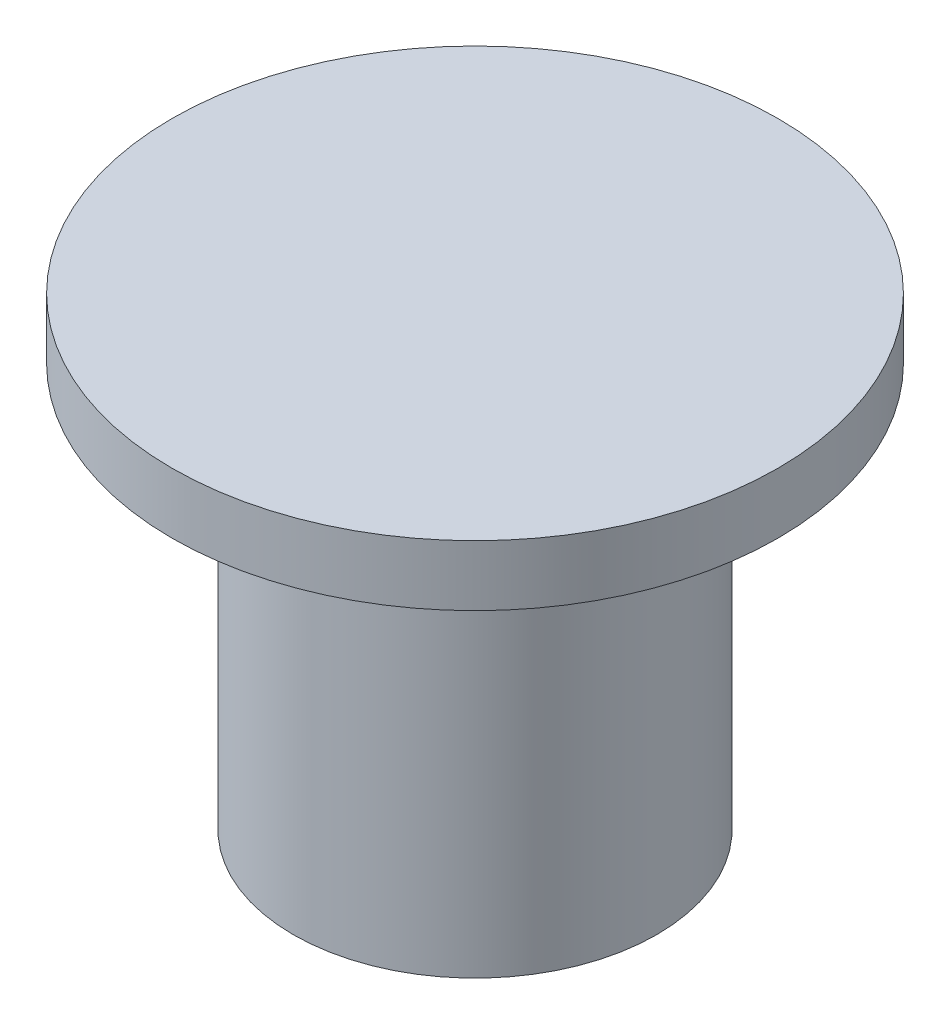
ISO-10303-21;
HEADER;
FILE_DESCRIPTION(('STEP AP214'),'2;1');
FILE_NAME('part.step','',(''),(''),'','','');
FILE_SCHEMA(('AUTOMOTIVE_DESIGN { 1 0 10303 214 1 1 1 1 }'));
ENDSEC;
DATA;
#1=APPLICATION_CONTEXT('core data for automotive mechanical design processes');
#2=APPLICATION_PROTOCOL_DEFINITION('international standard','automotive_design',2000,#1);
#3=PRODUCT_CONTEXT('',#1,'mechanical');
#4=PRODUCT('Part','Part','',(#3));
#5=PRODUCT_RELATED_PRODUCT_CATEGORY('part','',(#4));
#6=PRODUCT_DEFINITION_FORMATION('','',#4);
#7=PRODUCT_DEFINITION_CONTEXT('part definition',#1,'design');
#8=PRODUCT_DEFINITION('design','',#6,#7);
#9=PRODUCT_DEFINITION_SHAPE('','',#8);
#10=(LENGTH_UNIT() NAMED_UNIT(*) SI_UNIT(.MILLI.,.METRE.));
#11=(NAMED_UNIT(*) PLANE_ANGLE_UNIT() SI_UNIT($,.RADIAN.));
#12=(NAMED_UNIT(*) SI_UNIT($,.STERADIAN.) SOLID_ANGLE_UNIT());
#13=UNCERTAINTY_MEASURE_WITH_UNIT(LENGTH_MEASURE(1.E-05),#10,'distance_accuracy_value','');
#14=(GEOMETRIC_REPRESENTATION_CONTEXT(3) GLOBAL_UNCERTAINTY_ASSIGNED_CONTEXT((#13)) GLOBAL_UNIT_ASSIGNED_CONTEXT((#10,
#11,#12)) REPRESENTATION_CONTEXT('',''));
#15=CARTESIAN_POINT('',(0.,0.,0.));
#16=DIRECTION('',(0.,0.,1.));
#17=DIRECTION('',(1.,0.,0.));
#18=AXIS2_PLACEMENT_3D('',#15,#16,#17);
#19=CARTESIAN_POINT('',(-79.5371754282038,27.6747877758913,0.));
#20=DIRECTION('',(0.,-1.,0.));
#21=DIRECTION('',(0.,0.,-1.));
#22=AXIS2_PLACEMENT_3D('',#19,#20,#21);
#23=PLANE('',#22);
#24=CARTESIAN_POINT('',(-79.5371754282038,27.6747877758913,0.));
#25=DIRECTION('',(0.,-1.,0.));
#26=DIRECTION('',(0.,0.,-1.));
#27=AXIS2_PLACEMENT_3D('',#24,#25,#26);
#28=CIRCLE('',#27,7.50000000000001);
#29=CARTESIAN_POINT('',(-79.5371754282038,27.6747877758913,-7.50000000000001));
#30=VERTEX_POINT('',#29);
#31=EDGE_CURVE('E10',#30,#30,#28,.T.);
#32=ORIENTED_EDGE('',*,*,#31,.F.);
#33=EDGE_LOOP('',(#32));
#34=FACE_BOUND('',#33,.T.);
#35=ADVANCED_FACE('F31',(#34),#23,.F.);
#36=CARTESIAN_POINT('',(-79.5371754282038,26.1747877758913,0.));
#37=DIRECTION('',(0.,-1.,0.));
#38=DIRECTION('',(0.,0.,-1.));
#39=AXIS2_PLACEMENT_3D('',#36,#37,#38);
#40=CYLINDRICAL_SURFACE('',#39,7.50000000000001);
#41=CARTESIAN_POINT('',(-79.5371754282038,26.1747877758913,0.));
#42=DIRECTION('',(0.,-1.,0.));
#43=DIRECTION('',(0.,0.,-1.));
#44=AXIS2_PLACEMENT_3D('',#41,#42,#43);
#45=CIRCLE('',#44,7.50000000000001);
#46=CARTESIAN_POINT('',(-79.5371754282038,26.1747877758913,-7.50000000000001));
#47=VERTEX_POINT('',#46);
#48=EDGE_CURVE('E37',#47,#47,#45,.T.);
#49=ORIENTED_EDGE('',*,*,#48,.F.);
#50=EDGE_LOOP('',(#49));
#51=FACE_BOUND('',#50,.T.);
#52=ORIENTED_EDGE('',*,*,#31,.T.);
#53=EDGE_LOOP('',(#52));
#54=FACE_BOUND('',#53,.T.);
#55=ADVANCED_FACE('F79',(#51,#54),#40,.T.);
#56=CARTESIAN_POINT('',(-87.0371754282038,26.1747877758913,0.));
#57=DIRECTION('',(0.,1.,0.));
#58=DIRECTION('',(0.,0.,1.));
#59=AXIS2_PLACEMENT_3D('',#56,#57,#58);
#60=PLANE('',#59);
#61=CARTESIAN_POINT('',(-79.5371754282038,26.1747877758913,0.));
#62=DIRECTION('',(0.,-1.,0.));
#63=DIRECTION('',(0.,0.,-1.));
#64=AXIS2_PLACEMENT_3D('',#61,#62,#63);
#65=CIRCLE('',#64,4.5);
#66=CARTESIAN_POINT('',(-79.5371754282038,26.1747877758913,-4.5));
#67=VERTEX_POINT('',#66);
#68=EDGE_CURVE('E41',#67,#67,#65,.T.);
#69=ORIENTED_EDGE('',*,*,#68,.F.);
#70=EDGE_LOOP('',(#69));
#71=FACE_BOUND('',#70,.T.);
#72=ORIENTED_EDGE('',*,*,#48,.T.);
#73=EDGE_LOOP('',(#72));
#74=FACE_BOUND('',#73,.T.);
#75=ADVANCED_FACE('F74',(#71,#74),#60,.F.);
#76=CARTESIAN_POINT('',(-79.5371754282038,26.1747877758913,0.));
#77=DIRECTION('',(0.,-1.,0.));
#78=DIRECTION('',(0.,0.,-1.));
#79=AXIS2_PLACEMENT_3D('',#76,#77,#78);
#80=CYLINDRICAL_SURFACE('',#79,4.5);
#81=CARTESIAN_POINT('',(-79.5371754282038,16.1747877758913,0.));
#82=DIRECTION('',(0.,-1.,0.));
#83=DIRECTION('',(0.,0.,-1.));
#84=AXIS2_PLACEMENT_3D('',#81,#82,#83);
#85=CIRCLE('',#84,4.5);
#86=CARTESIAN_POINT('',(-79.5371754282038,16.1747877758913,-4.5));
#87=VERTEX_POINT('',#86);
#88=EDGE_CURVE('E45',#87,#87,#85,.T.);
#89=ORIENTED_EDGE('',*,*,#88,.F.);
#90=EDGE_LOOP('',(#89));
#91=FACE_BOUND('',#90,.T.);
#92=ORIENTED_EDGE('',*,*,#68,.T.);
#93=EDGE_LOOP('',(#92));
#94=FACE_BOUND('',#93,.T.);
#95=ADVANCED_FACE('F68',(#91,#94),#80,.T.);
#96=CARTESIAN_POINT('',(-84.0371754282038,16.1747877758913,0.));
#97=DIRECTION('',(0.,1.,0.));
#98=DIRECTION('',(0.,0.,1.));
#99=AXIS2_PLACEMENT_3D('',#96,#97,#98);
#100=PLANE('',#99);
#101=CARTESIAN_POINT('',(-79.5371754282038,16.1747877758913,0.));
#102=DIRECTION('',(0.,-1.,0.));
#103=DIRECTION('',(0.,0.,-1.));
#104=AXIS2_PLACEMENT_3D('',#101,#102,#103);
#105=CIRCLE('',#104,3.5);
#106=CARTESIAN_POINT('',(-79.5371754282038,16.1747877758913,-3.5));
#107=VERTEX_POINT('',#106);
#108=EDGE_CURVE('E50',#107,#107,#105,.T.);
#109=ORIENTED_EDGE('',*,*,#108,.F.);
#110=EDGE_LOOP('',(#109));
#111=FACE_BOUND('',#110,.T.);
#112=ORIENTED_EDGE('',*,*,#88,.T.);
#113=EDGE_LOOP('',(#112));
#114=FACE_BOUND('',#113,.T.);
#115=ADVANCED_FACE('F62',(#111,#114),#100,.F.);
#116=CARTESIAN_POINT('',(-79.5371754282038,26.1747877758913,0.));
#117=DIRECTION('',(0.,-1.,0.));
#118=DIRECTION('',(0.,0.,-1.));
#119=AXIS2_PLACEMENT_3D('',#116,#117,#118);
#120=CYLINDRICAL_SURFACE('',#119,3.5);
#121=CARTESIAN_POINT('',(-79.5371754282038,26.1747877758913,0.));
#122=DIRECTION('',(0.,-1.,0.));
#123=DIRECTION('',(0.,0.,-1.));
#124=AXIS2_PLACEMENT_3D('',#121,#122,#123);
#125=CIRCLE('',#124,3.5);
#126=CARTESIAN_POINT('',(-79.5371754282038,26.1747877758913,-3.5));
#127=VERTEX_POINT('',#126);
#128=EDGE_CURVE('E53',#127,#127,#125,.T.);
#129=ORIENTED_EDGE('',*,*,#128,.F.);
#130=EDGE_LOOP('',(#129));
#131=FACE_BOUND('',#130,.T.);
#132=ORIENTED_EDGE('',*,*,#108,.T.);
#133=EDGE_LOOP('',(#132));
#134=FACE_BOUND('',#133,.T.);
#135=ADVANCED_FACE('F59',(#131,#134),#120,.F.);
#136=CARTESIAN_POINT('',(-83.0371754282038,26.1747877758913,0.));
#137=DIRECTION('',(0.,1.,0.));
#138=DIRECTION('',(0.,0.,1.));
#139=AXIS2_PLACEMENT_3D('',#136,#137,#138);
#140=PLANE('',#139);
#141=ORIENTED_EDGE('',*,*,#128,.T.);
#142=EDGE_LOOP('',(#141));
#143=FACE_BOUND('',#142,.T.);
#144=ADVANCED_FACE('F57',(#143),#140,.F.);
#145=CLOSED_SHELL('',(#35,#55,#75,#95,#115,#135,#144));
#146=MANIFOLD_SOLID_BREP('B2',#145);
#147=ADVANCED_BREP_SHAPE_REPRESENTATION('',(#18,#146),#14);
#148=SHAPE_DEFINITION_REPRESENTATION(#9,#147);
ENDSEC;
END-ISO-10303-21;
